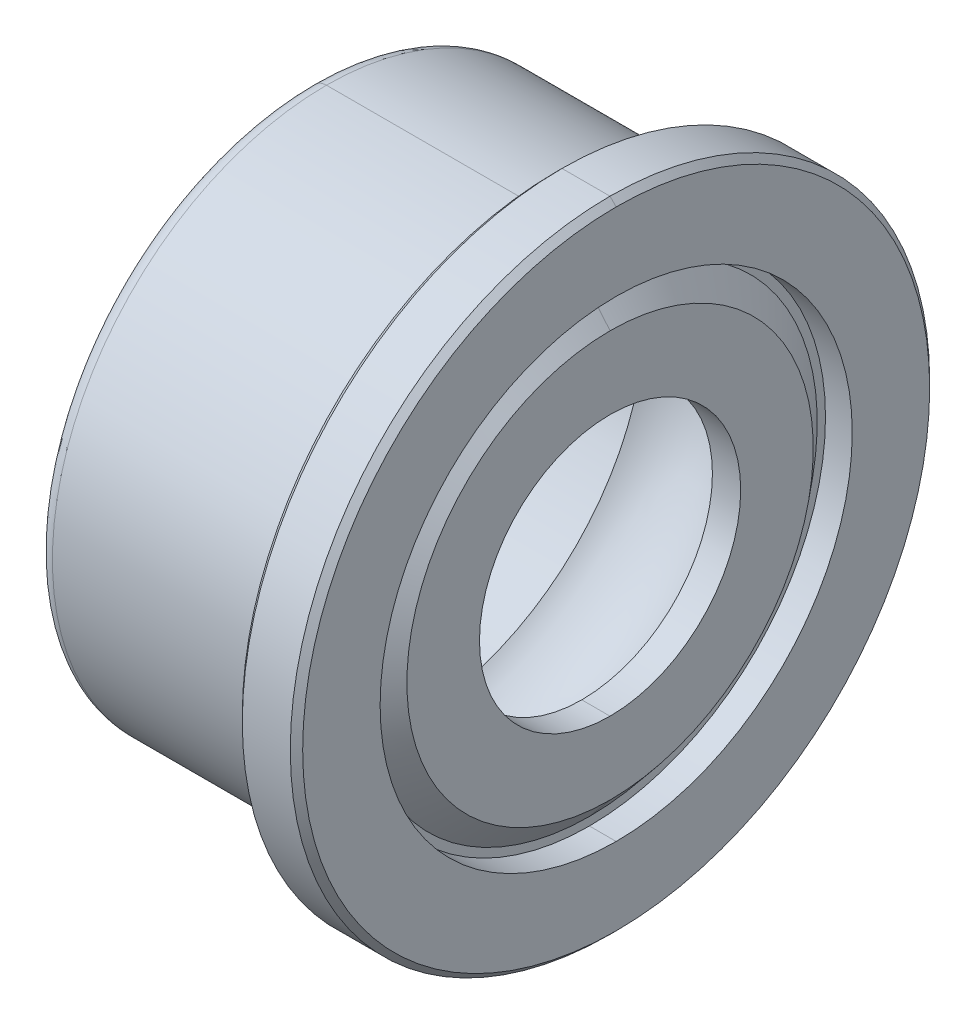
ISO-10303-21;
HEADER;
FILE_DESCRIPTION(('STEP AP214'),'2;1');
FILE_NAME('part.step','',(''),(''),'','','');
FILE_SCHEMA(('AUTOMOTIVE_DESIGN { 1 0 10303 214 1 1 1 1 }'));
ENDSEC;
DATA;
#1=APPLICATION_CONTEXT('core data for automotive mechanical design processes');
#2=APPLICATION_PROTOCOL_DEFINITION('international standard','automotive_design',2000,#1);
#3=PRODUCT_CONTEXT('',#1,'mechanical');
#4=PRODUCT('Part','Part','',(#3));
#5=PRODUCT_RELATED_PRODUCT_CATEGORY('part','',(#4));
#6=PRODUCT_DEFINITION_FORMATION('','',#4);
#7=PRODUCT_DEFINITION_CONTEXT('part definition',#1,'design');
#8=PRODUCT_DEFINITION('design','',#6,#7);
#9=PRODUCT_DEFINITION_SHAPE('','',#8);
#10=(LENGTH_UNIT() NAMED_UNIT(*) SI_UNIT(.MILLI.,.METRE.));
#11=(NAMED_UNIT(*) PLANE_ANGLE_UNIT() SI_UNIT($,.RADIAN.));
#12=(NAMED_UNIT(*) SI_UNIT($,.STERADIAN.) SOLID_ANGLE_UNIT());
#13=UNCERTAINTY_MEASURE_WITH_UNIT(LENGTH_MEASURE(1.E-05),#10,'distance_accuracy_value','');
#14=(GEOMETRIC_REPRESENTATION_CONTEXT(3) GLOBAL_UNCERTAINTY_ASSIGNED_CONTEXT((#13)) GLOBAL_UNIT_ASSIGNED_CONTEXT((#10,
#11,#12)) REPRESENTATION_CONTEXT('',''));
#15=CARTESIAN_POINT('',(0.,0.,0.));
#16=DIRECTION('',(0.,0.,1.));
#17=DIRECTION('',(1.,0.,0.));
#18=AXIS2_PLACEMENT_3D('',#15,#16,#17);
#19=CARTESIAN_POINT('',(-2.75209,0.,0.));
#20=DIRECTION('',(1.,0.,0.));
#21=DIRECTION('',(0.,-1.,0.));
#22=AXIS2_PLACEMENT_3D('',#19,#20,#21);
#23=CYLINDRICAL_SURFACE('',#22,3.872865);
#24=DIRECTION('',(1.,0.,0.));
#25=VECTOR('',#24,1.);
#26=CARTESIAN_POINT('',(0.893356989268567,3.872865,0.));
#27=LINE('',#26,#25);
#28=CARTESIAN_POINT('',(0.893356989268568,3.872865,0.));
#29=VERTEX_POINT('',#28);
#30=CARTESIAN_POINT('',(1.93804322400718,3.872865,0.));
#31=VERTEX_POINT('',#30);
#32=EDGE_CURVE('E20',#29,#31,#27,.T.);
#33=ORIENTED_EDGE('',*,*,#32,.F.);
#34=CARTESIAN_POINT('',(0.893356989268566,0.,0.));
#35=DIRECTION('',(-1.,0.,0.));
#36=DIRECTION('',(0.,1.,0.));
#37=AXIS2_PLACEMENT_3D('',#34,#35,#36);
#38=CIRCLE('',#37,3.872865);
#39=CARTESIAN_POINT('',(0.893356989268568,-3.872865,0.));
#40=VERTEX_POINT('',#39);
#41=EDGE_CURVE('E285',#29,#40,#38,.T.);
#42=ORIENTED_EDGE('',*,*,#41,.T.);
#43=DIRECTION('',(1.,0.,0.));
#44=VECTOR('',#43,1.);
#45=CARTESIAN_POINT('',(0.893356989268567,-3.872865,0.));
#46=LINE('',#45,#44);
#47=CARTESIAN_POINT('',(1.93804322400718,-3.872865,0.));
#48=VERTEX_POINT('',#47);
#49=EDGE_CURVE('E25',#40,#48,#46,.T.);
#50=ORIENTED_EDGE('',*,*,#49,.T.);
#51=CARTESIAN_POINT('',(1.93804322400718,0.,0.));
#52=DIRECTION('',(1.,0.,0.));
#53=DIRECTION('',(0.,-1.,0.));
#54=AXIS2_PLACEMENT_3D('',#51,#52,#53);
#55=CIRCLE('',#54,3.872865);
#56=EDGE_CURVE('E11',#48,#31,#55,.T.);
#57=ORIENTED_EDGE('',*,*,#56,.T.);
#58=EDGE_LOOP('',(#33,#42,#50,#57));
#59=FACE_BOUND('',#58,.T.);
#60=ADVANCED_FACE('F17',(#59),#23,.F.);
#61=CARTESIAN_POINT('',(1.93804322400718,0.,0.));
#62=DIRECTION('',(1.,0.,0.));
#63=DIRECTION('',(0.,-1.,0.));
#64=AXIS2_PLACEMENT_3D('',#61,#62,#63);
#65=PLANE('',#64);
#66=CARTESIAN_POINT('',(1.93804322400718,0.,0.));
#67=DIRECTION('',(-1.,0.,0.));
#68=DIRECTION('',(0.,1.,0.));
#69=AXIS2_PLACEMENT_3D('',#66,#67,#68);
#70=CIRCLE('',#69,2.14275035);
#71=CARTESIAN_POINT('',(1.93804322400718,2.14275035,0.));
#72=VERTEX_POINT('',#71);
#73=CARTESIAN_POINT('',(1.93804322400718,-2.14275035,0.));
#74=VERTEX_POINT('',#73);
#75=EDGE_CURVE('E845',#72,#74,#70,.T.);
#76=ORIENTED_EDGE('',*,*,#75,.F.);
#77=CARTESIAN_POINT('',(1.93804322400718,0.,0.));
#78=DIRECTION('',(1.,0.,0.));
#79=DIRECTION('',(0.,1.,0.));
#80=AXIS2_PLACEMENT_3D('',#77,#78,#79);
#81=CIRCLE('',#80,2.14275035);
#82=EDGE_CURVE('E847',#72,#74,#81,.T.);
#83=ORIENTED_EDGE('',*,*,#82,.T.);
#84=EDGE_LOOP('',(#76,#83));
#85=FACE_BOUND('',#84,.T.);
#86=ORIENTED_EDGE('',*,*,#56,.F.);
#87=CARTESIAN_POINT('',(1.93804322400718,0.,0.));
#88=DIRECTION('',(1.,0.,0.));
#89=DIRECTION('',(0.,1.,0.));
#90=AXIS2_PLACEMENT_3D('',#87,#88,#89);
#91=CIRCLE('',#90,3.872865);
#92=EDGE_CURVE('E294',#31,#48,#91,.T.);
#93=ORIENTED_EDGE('',*,*,#92,.F.);
#94=EDGE_LOOP('',(#86,#93));
#95=FACE_BOUND('',#94,.T.);
#96=ADVANCED_FACE('F336',(#85,#95),#65,.F.);
#97=CARTESIAN_POINT('',(-2.75209,0.,0.));
#98=DIRECTION('',(1.,0.,0.));
#99=DIRECTION('',(0.,-1.,0.));
#100=AXIS2_PLACEMENT_3D('',#97,#98,#99);
#101=CYLINDRICAL_SURFACE('',#100,3.872865);
#102=ORIENTED_EDGE('',*,*,#49,.F.);
#103=CARTESIAN_POINT('',(0.893356989268566,0.,0.));
#104=DIRECTION('',(1.,0.,0.));
#105=DIRECTION('',(0.,1.,0.));
#106=AXIS2_PLACEMENT_3D('',#103,#104,#105);
#107=CIRCLE('',#106,3.872865);
#108=EDGE_CURVE('E289',#29,#40,#107,.T.);
#109=ORIENTED_EDGE('',*,*,#108,.F.);
#110=ORIENTED_EDGE('',*,*,#32,.T.);
#111=ORIENTED_EDGE('',*,*,#92,.T.);
#112=EDGE_LOOP('',(#102,#109,#110,#111));
#113=FACE_BOUND('',#112,.T.);
#114=ADVANCED_FACE('F308',(#113),#101,.F.);
#115=CARTESIAN_POINT('',(0.,0.,0.));
#116=DIRECTION('',(1.,0.,0.));
#117=DIRECTION('',(0.,-1.,0.));
#118=AXIS2_PLACEMENT_3D('',#115,#116,#117);
#119=TOROIDAL_SURFACE('',#118,2.9972,1.25095);
#120=ORIENTED_EDGE('',*,*,#108,.T.);
#121=CARTESIAN_POINT('',(0.,-2.9972,0.));
#122=DIRECTION('',(0.,0.,1.));
#123=DIRECTION('',(-0.714142842854285,-0.7,0.));
#124=AXIS2_PLACEMENT_3D('',#121,#122,#123);
#125=CIRCLE('',#124,1.25095);
#126=CARTESIAN_POINT('',(-0.893356989268568,-3.872865,0.));
#127=VERTEX_POINT('',#126);
#128=EDGE_CURVE('E286',#127,#40,#125,.T.);
#129=ORIENTED_EDGE('',*,*,#128,.F.);
#130=CARTESIAN_POINT('',(-0.893356989268568,0.,0.));
#131=DIRECTION('',(1.,0.,0.));
#132=DIRECTION('',(0.,1.,0.));
#133=AXIS2_PLACEMENT_3D('',#130,#131,#132);
#134=CIRCLE('',#133,3.872865);
#135=CARTESIAN_POINT('',(-0.893356989268568,3.872865,0.));
#136=VERTEX_POINT('',#135);
#137=EDGE_CURVE('E279',#136,#127,#134,.T.);
#138=ORIENTED_EDGE('',*,*,#137,.F.);
#139=CARTESIAN_POINT('',(0.,2.9972,0.));
#140=DIRECTION('',(0.,0.,-1.));
#141=DIRECTION('',(-0.714142842854285,0.7,0.));
#142=AXIS2_PLACEMENT_3D('',#139,#140,#141);
#143=CIRCLE('',#142,1.25095);
#144=EDGE_CURVE('E282',#136,#29,#143,.T.);
#145=ORIENTED_EDGE('',*,*,#144,.T.);
#146=EDGE_LOOP('',(#120,#129,#138,#145));
#147=FACE_BOUND('',#146,.T.);
#148=ADVANCED_FACE('F311',(#147),#119,.F.);
#149=CARTESIAN_POINT('',(0.,0.,0.));
#150=DIRECTION('',(1.,0.,0.));
#151=DIRECTION('',(0.,-1.,0.));
#152=AXIS2_PLACEMENT_3D('',#149,#150,#151);
#153=TOROIDAL_SURFACE('',#152,2.9972,1.25095);
#154=CARTESIAN_POINT('',(-0.893356989268568,0.,0.));
#155=DIRECTION('',(-1.,0.,0.));
#156=DIRECTION('',(0.,1.,0.));
#157=AXIS2_PLACEMENT_3D('',#154,#155,#156);
#158=CIRCLE('',#157,3.872865);
#159=EDGE_CURVE('E278',#136,#127,#158,.T.);
#160=ORIENTED_EDGE('',*,*,#159,.T.);
#161=ORIENTED_EDGE('',*,*,#128,.T.);
#162=ORIENTED_EDGE('',*,*,#41,.F.);
#163=ORIENTED_EDGE('',*,*,#144,.F.);
#164=EDGE_LOOP('',(#160,#161,#162,#163));
#165=FACE_BOUND('',#164,.T.);
#166=ADVANCED_FACE('F312',(#165),#153,.F.);
#167=CARTESIAN_POINT('',(-2.75209,0.,0.));
#168=DIRECTION('',(1.,0.,0.));
#169=DIRECTION('',(0.,-1.,0.));
#170=AXIS2_PLACEMENT_3D('',#167,#168,#169);
#171=CYLINDRICAL_SURFACE('',#170,3.872865);
#172=DIRECTION('',(1.,0.,0.));
#173=VECTOR('',#172,1.);
#174=CARTESIAN_POINT('',(-1.93804322400718,-3.872865,0.));
#175=LINE('',#174,#173);
#176=CARTESIAN_POINT('',(-1.93804322400718,-3.872865,0.));
#177=VERTEX_POINT('',#176);
#178=EDGE_CURVE('E274',#177,#127,#175,.T.);
#179=ORIENTED_EDGE('',*,*,#178,.T.);
#180=ORIENTED_EDGE('',*,*,#159,.F.);
#181=DIRECTION('',(1.,0.,0.));
#182=VECTOR('',#181,1.);
#183=CARTESIAN_POINT('',(-1.93804322400718,3.872865,0.));
#184=LINE('',#183,#182);
#185=CARTESIAN_POINT('',(-1.93804322400718,3.872865,0.));
#186=VERTEX_POINT('',#185);
#187=EDGE_CURVE('E275',#186,#136,#184,.T.);
#188=ORIENTED_EDGE('',*,*,#187,.F.);
#189=CARTESIAN_POINT('',(-1.93804322400718,0.,0.));
#190=DIRECTION('',(1.,0.,0.));
#191=DIRECTION('',(0.,-1.,0.));
#192=AXIS2_PLACEMENT_3D('',#189,#190,#191);
#193=CIRCLE('',#192,3.872865);
#194=EDGE_CURVE('E271',#177,#186,#193,.T.);
#195=ORIENTED_EDGE('',*,*,#194,.F.);
#196=EDGE_LOOP('',(#179,#180,#188,#195));
#197=FACE_BOUND('',#196,.T.);
#198=ADVANCED_FACE('F316',(#197),#171,.F.);
#199=CARTESIAN_POINT('',(-2.75209,0.,0.));
#200=DIRECTION('',(1.,0.,0.));
#201=DIRECTION('',(0.,-1.,0.));
#202=AXIS2_PLACEMENT_3D('',#199,#200,#201);
#203=CYLINDRICAL_SURFACE('',#202,3.872865);
#204=ORIENTED_EDGE('',*,*,#187,.T.);
#205=ORIENTED_EDGE('',*,*,#137,.T.);
#206=ORIENTED_EDGE('',*,*,#178,.F.);
#207=CARTESIAN_POINT('',(-1.93804322400718,0.,0.));
#208=DIRECTION('',(1.,0.,0.));
#209=DIRECTION('',(0.,1.,0.));
#210=AXIS2_PLACEMENT_3D('',#207,#208,#209);
#211=CIRCLE('',#210,3.872865);
#212=EDGE_CURVE('E266',#186,#177,#211,.T.);
#213=ORIENTED_EDGE('',*,*,#212,.F.);
#214=EDGE_LOOP('',(#204,#205,#206,#213));
#215=FACE_BOUND('',#214,.T.);
#216=ADVANCED_FACE('F319',(#215),#203,.F.);
#217=CARTESIAN_POINT('',(-1.93804322400718,0.,0.));
#218=DIRECTION('',(1.,0.,0.));
#219=DIRECTION('',(0.,-1.,0.));
#220=AXIS2_PLACEMENT_3D('',#217,#218,#219);
#221=PLANE('',#220);
#222=CARTESIAN_POINT('',(-1.93804322400718,0.,0.));
#223=DIRECTION('',(1.,0.,0.));
#224=DIRECTION('',(0.,1.,0.));
#225=AXIS2_PLACEMENT_3D('',#222,#223,#224);
#226=CIRCLE('',#225,2.14275035);
#227=CARTESIAN_POINT('',(-1.93804322400718,2.14275035,0.));
#228=VERTEX_POINT('',#227);
#229=CARTESIAN_POINT('',(-1.93804322400718,-2.14275035,0.));
#230=VERTEX_POINT('',#229);
#231=EDGE_CURVE('E262',#228,#230,#226,.T.);
#232=ORIENTED_EDGE('',*,*,#231,.F.);
#233=CARTESIAN_POINT('',(-1.93804322400718,0.,0.));
#234=DIRECTION('',(-1.,0.,0.));
#235=DIRECTION('',(0.,1.,0.));
#236=AXIS2_PLACEMENT_3D('',#233,#234,#235);
#237=CIRCLE('',#236,2.14275035);
#238=EDGE_CURVE('E264',#228,#230,#237,.T.);
#239=ORIENTED_EDGE('',*,*,#238,.T.);
#240=EDGE_LOOP('',(#232,#239));
#241=FACE_BOUND('',#240,.T.);
#242=ORIENTED_EDGE('',*,*,#194,.T.);
#243=ORIENTED_EDGE('',*,*,#212,.T.);
#244=EDGE_LOOP('',(#242,#243));
#245=FACE_BOUND('',#244,.T.);
#246=ADVANCED_FACE('F321',(#241,#245),#221,.T.);
#247=CARTESIAN_POINT('',(-2.6420064,0.,0.));
#248=DIRECTION('',(1.,0.,0.));
#249=DIRECTION('',(0.,-1.,0.));
#250=AXIS2_PLACEMENT_3D('',#247,#248,#249);
#251=CYLINDRICAL_SURFACE('',#250,2.14275035);
#252=CARTESIAN_POINT('',(-2.401824,0.,0.));
#253=DIRECTION('',(-1.,0.,0.));
#254=DIRECTION('',(0.,1.,0.));
#255=AXIS2_PLACEMENT_3D('',#252,#253,#254);
#256=CIRCLE('',#255,2.14275035);
#257=CARTESIAN_POINT('',(-2.401824,2.14275035,0.));
#258=VERTEX_POINT('',#257);
#259=CARTESIAN_POINT('',(-2.401824,-2.14275035,0.));
#260=VERTEX_POINT('',#259);
#261=EDGE_CURVE('E255',#258,#260,#256,.T.);
#262=ORIENTED_EDGE('',*,*,#261,.T.);
#263=DIRECTION('',(1.,0.,0.));
#264=VECTOR('',#263,1.);
#265=CARTESIAN_POINT('',(-2.401824,-2.14275035,0.));
#266=LINE('',#265,#264);
#267=EDGE_CURVE('E259',#260,#230,#266,.T.);
#268=ORIENTED_EDGE('',*,*,#267,.T.);
#269=ORIENTED_EDGE('',*,*,#238,.F.);
#270=DIRECTION('',(1.,0.,0.));
#271=VECTOR('',#270,1.);
#272=CARTESIAN_POINT('',(-2.401824,2.14275035,0.));
#273=LINE('',#272,#271);
#274=EDGE_CURVE('E256',#258,#228,#273,.T.);
#275=ORIENTED_EDGE('',*,*,#274,.F.);
#276=EDGE_LOOP('',(#262,#268,#269,#275));
#277=FACE_BOUND('',#276,.T.);
#278=ADVANCED_FACE('F323',(#277),#251,.F.);
#279=CARTESIAN_POINT('',(-2.6420064,0.,0.));
#280=DIRECTION('',(1.,0.,0.));
#281=DIRECTION('',(0.,-1.,0.));
#282=AXIS2_PLACEMENT_3D('',#279,#280,#281);
#283=CYLINDRICAL_SURFACE('',#282,2.14275035);
#284=ORIENTED_EDGE('',*,*,#231,.T.);
#285=ORIENTED_EDGE('',*,*,#267,.F.);
#286=CARTESIAN_POINT('',(-2.401824,0.,0.));
#287=DIRECTION('',(1.,0.,0.));
#288=DIRECTION('',(0.,1.,0.));
#289=AXIS2_PLACEMENT_3D('',#286,#287,#288);
#290=CIRCLE('',#289,2.14275035);
#291=EDGE_CURVE('E250',#258,#260,#290,.T.);
#292=ORIENTED_EDGE('',*,*,#291,.F.);
#293=ORIENTED_EDGE('',*,*,#274,.T.);
#294=EDGE_LOOP('',(#284,#285,#292,#293));
#295=FACE_BOUND('',#294,.T.);
#296=ADVANCED_FACE('F331',(#295),#283,.F.);
#297=CARTESIAN_POINT('',(-2.401824,0.,0.));
#298=DIRECTION('',(1.,0.,0.));
#299=DIRECTION('',(0.,-1.,0.));
#300=AXIS2_PLACEMENT_3D('',#297,#298,#299);
#301=PLANE('',#300);
#302=ORIENTED_EDGE('',*,*,#261,.F.);
#303=ORIENTED_EDGE('',*,*,#291,.T.);
#304=EDGE_LOOP('',(#302,#303));
#305=FACE_BOUND('',#304,.T.);
#306=CARTESIAN_POINT('',(-2.401824,0.,0.));
#307=DIRECTION('',(1.,0.,0.));
#308=DIRECTION('',(0.,1.,0.));
#309=AXIS2_PLACEMENT_3D('',#306,#307,#308);
#310=CIRCLE('',#309,3.3336847347);
#311=CARTESIAN_POINT('',(-2.401824,3.3336847347,0.));
#312=VERTEX_POINT('',#311);
#313=CARTESIAN_POINT('',(-2.401824,-3.3336847347,0.));
#314=VERTEX_POINT('',#313);
#315=EDGE_CURVE('E246',#312,#314,#310,.T.);
#316=ORIENTED_EDGE('',*,*,#315,.F.);
#317=CARTESIAN_POINT('',(-2.401824,0.,0.));
#318=DIRECTION('',(-1.,0.,0.));
#319=DIRECTION('',(0.,1.,0.));
#320=AXIS2_PLACEMENT_3D('',#317,#318,#319);
#321=CIRCLE('',#320,3.3336847347);
#322=EDGE_CURVE('E248',#312,#314,#321,.T.);
#323=ORIENTED_EDGE('',*,*,#322,.T.);
#324=EDGE_LOOP('',(#316,#323));
#325=FACE_BOUND('',#324,.T.);
#326=ADVANCED_FACE('F387',(#305,#325),#301,.F.);
#327=CARTESIAN_POINT('',(-2.41390058018481,0.,0.));
#328=DIRECTION('',(1.,0.,0.));
#329=DIRECTION('',(0.,-1.,0.));
#330=AXIS2_PLACEMENT_3D('',#327,#328,#329);
#331=CONICAL_SURFACE('',#330,3.3192924268785,0.872664625997165);
#332=CARTESIAN_POINT('',(-2.06313822400718,0.,0.));
#333=DIRECTION('',(-1.,0.,0.));
#334=DIRECTION('',(0.,1.,0.));
#335=AXIS2_PLACEMENT_3D('',#332,#333,#334);
#336=CIRCLE('',#335,3.737314725);
#337=CARTESIAN_POINT('',(-2.06313822400718,3.737314725,0.));
#338=VERTEX_POINT('',#337);
#339=CARTESIAN_POINT('',(-2.06313822400718,-3.737314725,0.));
#340=VERTEX_POINT('',#339);
#341=EDGE_CURVE('E239',#338,#340,#336,.T.);
#342=ORIENTED_EDGE('',*,*,#341,.T.);
#343=DIRECTION('',(-0.642787609686539,0.766044443118978,0.));
#344=VECTOR('',#343,1.);
#345=CARTESIAN_POINT('',(-2.06313822400718,-3.737314725,0.));
#346=LINE('',#345,#344);
#347=EDGE_CURVE('E243',#340,#314,#346,.T.);
#348=ORIENTED_EDGE('',*,*,#347,.T.);
#349=ORIENTED_EDGE('',*,*,#322,.F.);
#350=DIRECTION('',(-0.642787609686539,-0.766044443118978,0.));
#351=VECTOR('',#350,1.);
#352=CARTESIAN_POINT('',(-2.06313822400718,3.737314725,0.));
#353=LINE('',#352,#351);
#354=EDGE_CURVE('E240',#338,#312,#353,.T.);
#355=ORIENTED_EDGE('',*,*,#354,.F.);
#356=EDGE_LOOP('',(#342,#348,#349,#355));
#357=FACE_BOUND('',#356,.T.);
#358=ADVANCED_FACE('F398',(#357),#331,.T.);
#359=CARTESIAN_POINT('',(-2.41390058018481,0.,0.));
#360=DIRECTION('',(1.,0.,0.));
#361=DIRECTION('',(0.,-1.,0.));
#362=AXIS2_PLACEMENT_3D('',#359,#360,#361);
#363=CONICAL_SURFACE('',#362,3.3192924268785,0.872664625997165);
#364=ORIENTED_EDGE('',*,*,#315,.T.);
#365=ORIENTED_EDGE('',*,*,#347,.F.);
#366=CARTESIAN_POINT('',(-2.06313822400718,0.,0.));
#367=DIRECTION('',(1.,0.,0.));
#368=DIRECTION('',(0.,1.,0.));
#369=AXIS2_PLACEMENT_3D('',#366,#367,#368);
#370=CIRCLE('',#369,3.737314725);
#371=EDGE_CURVE('E231',#338,#340,#370,.T.);
#372=ORIENTED_EDGE('',*,*,#371,.F.);
#373=ORIENTED_EDGE('',*,*,#354,.T.);
#374=EDGE_LOOP('',(#364,#365,#372,#373));
#375=FACE_BOUND('',#374,.T.);
#376=ADVANCED_FACE('F409',(#375),#363,.T.);
#377=CARTESIAN_POINT('',(-2.75209,0.,0.));
#378=DIRECTION('',(1.,0.,0.));
#379=DIRECTION('',(0.,-1.,0.));
#380=AXIS2_PLACEMENT_3D('',#377,#378,#379);
#381=CYLINDRICAL_SURFACE('',#380,3.872865);
#382=DIRECTION('',(1.,0.,0.));
#383=VECTOR('',#382,1.);
#384=CARTESIAN_POINT('',(-2.5019,3.872865,0.));
#385=LINE('',#384,#383);
#386=CARTESIAN_POINT('',(-2.5019,3.872865,0.));
#387=VERTEX_POINT('',#386);
#388=CARTESIAN_POINT('',(-2.06313822400718,3.872865,0.));
#389=VERTEX_POINT('',#388);
#390=EDGE_CURVE('E225',#387,#389,#385,.T.);
#391=ORIENTED_EDGE('',*,*,#390,.F.);
#392=CARTESIAN_POINT('',(-2.5019,0.,0.));
#393=DIRECTION('',(-1.,0.,0.));
#394=DIRECTION('',(0.,1.,0.));
#395=AXIS2_PLACEMENT_3D('',#392,#393,#394);
#396=CIRCLE('',#395,3.872865);
#397=CARTESIAN_POINT('',(-2.5019,-3.872865,0.));
#398=VERTEX_POINT('',#397);
#399=EDGE_CURVE('E226',#387,#398,#396,.T.);
#400=ORIENTED_EDGE('',*,*,#399,.T.);
#401=DIRECTION('',(1.,0.,0.));
#402=VECTOR('',#401,1.);
#403=CARTESIAN_POINT('',(-2.5019,-3.872865,0.));
#404=LINE('',#403,#402);
#405=CARTESIAN_POINT('',(-2.06313822400718,-3.872865,0.));
#406=VERTEX_POINT('',#405);
#407=EDGE_CURVE('E232',#398,#406,#404,.T.);
#408=ORIENTED_EDGE('',*,*,#407,.T.);
#409=CARTESIAN_POINT('',(-2.06313822400718,0.,0.));
#410=DIRECTION('',(1.,0.,0.));
#411=DIRECTION('',(0.,-1.,0.));
#412=AXIS2_PLACEMENT_3D('',#409,#410,#411);
#413=CIRCLE('',#412,3.872865);
#414=EDGE_CURVE('E229',#406,#389,#413,.T.);
#415=ORIENTED_EDGE('',*,*,#414,.T.);
#416=EDGE_LOOP('',(#391,#400,#408,#415));
#417=FACE_BOUND('',#416,.T.);
#418=ADVANCED_FACE('F420',(#417),#381,.F.);
#419=CARTESIAN_POINT('',(-2.06313822400718,0.,0.));
#420=DIRECTION('',(1.,0.,0.));
#421=DIRECTION('',(0.,-1.,0.));
#422=AXIS2_PLACEMENT_3D('',#419,#420,#421);
#423=PLANE('',#422);
#424=ORIENTED_EDGE('',*,*,#341,.F.);
#425=ORIENTED_EDGE('',*,*,#371,.T.);
#426=EDGE_LOOP('',(#424,#425));
#427=FACE_BOUND('',#426,.T.);
#428=ORIENTED_EDGE('',*,*,#414,.F.);
#429=CARTESIAN_POINT('',(-2.06313822400718,0.,0.));
#430=DIRECTION('',(1.,0.,0.));
#431=DIRECTION('',(0.,1.,0.));
#432=AXIS2_PLACEMENT_3D('',#429,#430,#431);
#433=CIRCLE('',#432,3.872865);
#434=EDGE_CURVE('E222',#389,#406,#433,.T.);
#435=ORIENTED_EDGE('',*,*,#434,.F.);
#436=EDGE_LOOP('',(#428,#435));
#437=FACE_BOUND('',#436,.T.);
#438=ADVANCED_FACE('F431',(#427,#437),#423,.F.);
#439=CARTESIAN_POINT('',(-2.75209,0.,0.));
#440=DIRECTION('',(1.,0.,0.));
#441=DIRECTION('',(0.,-1.,0.));
#442=AXIS2_PLACEMENT_3D('',#439,#440,#441);
#443=CYLINDRICAL_SURFACE('',#442,3.872865);
#444=ORIENTED_EDGE('',*,*,#407,.F.);
#445=CARTESIAN_POINT('',(-2.5019,0.,0.));
#446=DIRECTION('',(1.,0.,0.));
#447=DIRECTION('',(0.,1.,0.));
#448=AXIS2_PLACEMENT_3D('',#445,#446,#447);
#449=CIRCLE('',#448,3.872865);
#450=EDGE_CURVE('E221',#387,#398,#449,.T.);
#451=ORIENTED_EDGE('',*,*,#450,.F.);
#452=ORIENTED_EDGE('',*,*,#390,.T.);
#453=ORIENTED_EDGE('',*,*,#434,.T.);
#454=EDGE_LOOP('',(#444,#451,#452,#453));
#455=FACE_BOUND('',#454,.T.);
#456=ADVANCED_FACE('F442',(#455),#443,.F.);
#457=CARTESIAN_POINT('',(-2.5019,0.,0.));
#458=DIRECTION('',(1.,0.,0.));
#459=DIRECTION('',(0.,-1.,0.));
#460=AXIS2_PLACEMENT_3D('',#457,#458,#459);
#461=PLANE('',#460);
#462=ORIENTED_EDGE('',*,*,#399,.F.);
#463=ORIENTED_EDGE('',*,*,#450,.T.);
#464=EDGE_LOOP('',(#462,#463));
#465=FACE_BOUND('',#464,.T.);
#466=CARTESIAN_POINT('',(-2.5019,0.,0.));
#467=DIRECTION('',(1.,0.,0.));
#468=DIRECTION('',(0.,1.,0.));
#469=AXIS2_PLACEMENT_3D('',#466,#467,#468);
#470=CIRCLE('',#469,4.24561);
#471=CARTESIAN_POINT('',(-2.5019,4.24561,0.));
#472=VERTEX_POINT('',#471);
#473=CARTESIAN_POINT('',(-2.5019,-4.24561,0.));
#474=VERTEX_POINT('',#473);
#475=EDGE_CURVE('E217',#472,#474,#470,.T.);
#476=ORIENTED_EDGE('',*,*,#475,.F.);
#477=CARTESIAN_POINT('',(-2.5019,0.,0.));
#478=DIRECTION('',(-1.,0.,0.));
#479=DIRECTION('',(0.,1.,0.));
#480=AXIS2_PLACEMENT_3D('',#477,#478,#479);
#481=CIRCLE('',#480,4.24561);
#482=EDGE_CURVE('E196',#472,#474,#481,.T.);
#483=ORIENTED_EDGE('',*,*,#482,.T.);
#484=EDGE_LOOP('',(#476,#483));
#485=FACE_BOUND('',#484,.T.);
#486=ADVANCED_FACE('F453',(#465,#485),#461,.F.);
#487=CARTESIAN_POINT('',(-2.25171,0.,0.));
#488=DIRECTION('',(1.,0.,0.));
#489=DIRECTION('',(0.,-1.,0.));
#490=AXIS2_PLACEMENT_3D('',#487,#488,#489);
#491=TOROIDAL_SURFACE('',#490,4.24561,0.25019);
#492=ORIENTED_EDGE('',*,*,#475,.T.);
#493=CARTESIAN_POINT('',(-2.25171,-4.24561,0.));
#494=DIRECTION('',(0.,0.,-1.));
#495=DIRECTION('',(0.,-1.,0.));
#496=AXIS2_PLACEMENT_3D('',#493,#494,#495);
#497=CIRCLE('',#496,0.25019);
#498=CARTESIAN_POINT('',(-2.25171,-4.4958,0.));
#499=VERTEX_POINT('',#498);
#500=EDGE_CURVE('E183',#499,#474,#497,.T.);
#501=ORIENTED_EDGE('',*,*,#500,.F.);
#502=CARTESIAN_POINT('',(-2.25171,0.,0.));
#503=DIRECTION('',(1.,0.,0.));
#504=DIRECTION('',(0.,1.,0.));
#505=AXIS2_PLACEMENT_3D('',#502,#503,#504);
#506=CIRCLE('',#505,4.4958);
#507=CARTESIAN_POINT('',(-2.25171,4.4958,0.));
#508=VERTEX_POINT('',#507);
#509=EDGE_CURVE('E176',#508,#499,#506,.T.);
#510=ORIENTED_EDGE('',*,*,#509,.F.);
#511=CARTESIAN_POINT('',(-2.25171,4.24561,0.));
#512=DIRECTION('',(0.,0.,1.));
#513=DIRECTION('',(0.,1.,0.));
#514=AXIS2_PLACEMENT_3D('',#511,#512,#513);
#515=CIRCLE('',#514,0.25019);
#516=EDGE_CURVE('E180',#508,#472,#515,.T.);
#517=ORIENTED_EDGE('',*,*,#516,.T.);
#518=EDGE_LOOP('',(#492,#501,#510,#517));
#519=FACE_BOUND('',#518,.T.);
#520=ADVANCED_FACE('F179',(#519),#491,.T.);
#521=CARTESIAN_POINT('',(-2.25171,0.,0.));
#522=DIRECTION('',(1.,0.,0.));
#523=DIRECTION('',(0.,-1.,0.));
#524=AXIS2_PLACEMENT_3D('',#521,#522,#523);
#525=TOROIDAL_SURFACE('',#524,4.24561,0.25019);
#526=CARTESIAN_POINT('',(-2.25171,0.,0.));
#527=DIRECTION('',(-1.,0.,0.));
#528=DIRECTION('',(0.,1.,0.));
#529=AXIS2_PLACEMENT_3D('',#526,#527,#528);
#530=CIRCLE('',#529,4.4958);
#531=EDGE_CURVE('E194',#508,#499,#530,.T.);
#532=ORIENTED_EDGE('',*,*,#531,.T.);
#533=ORIENTED_EDGE('',*,*,#500,.T.);
#534=ORIENTED_EDGE('',*,*,#482,.F.);
#535=ORIENTED_EDGE('',*,*,#516,.F.);
#536=EDGE_LOOP('',(#532,#533,#534,#535));
#537=FACE_BOUND('',#536,.T.);
#538=ADVANCED_FACE('F193',(#537),#525,.T.);
#539=CARTESIAN_POINT('',(1.3462,0.,0.));
#540=DIRECTION('',(1.,0.,0.));
#541=DIRECTION('',(0.,-1.,0.));
#542=AXIS2_PLACEMENT_3D('',#539,#540,#541);
#543=TOROIDAL_SURFACE('',#542,4.6609,0.1651);
#544=CARTESIAN_POINT('',(1.3462,4.6609,0.));
#545=DIRECTION('',(0.,0.,-1.));
#546=DIRECTION('',(1.,0.,0.));
#547=AXIS2_PLACEMENT_3D('',#544,#545,#546);
#548=CIRCLE('',#547,0.1651);
#549=CARTESIAN_POINT('',(1.5113,4.6609,0.));
#550=VERTEX_POINT('',#549);
#551=CARTESIAN_POINT('',(1.3462,4.4958,0.));
#552=VERTEX_POINT('',#551);
#553=EDGE_CURVE('E212',#550,#552,#548,.T.);
#554=ORIENTED_EDGE('',*,*,#553,.F.);
#555=CARTESIAN_POINT('',(1.5113,0.,0.));
#556=DIRECTION('',(-1.,0.,0.));
#557=DIRECTION('',(0.,1.,0.));
#558=AXIS2_PLACEMENT_3D('',#555,#556,#557);
#559=CIRCLE('',#558,4.6609);
#560=CARTESIAN_POINT('',(1.5113,-4.6609,0.));
#561=VERTEX_POINT('',#560);
#562=EDGE_CURVE('E213',#550,#561,#559,.T.);
#563=ORIENTED_EDGE('',*,*,#562,.T.);
#564=CARTESIAN_POINT('',(1.3462,-4.6609,0.));
#565=DIRECTION('',(0.,0.,1.));
#566=DIRECTION('',(1.,0.,0.));
#567=AXIS2_PLACEMENT_3D('',#564,#565,#566);
#568=CIRCLE('',#567,0.1651);
#569=CARTESIAN_POINT('',(1.3462,-4.4958,0.));
#570=VERTEX_POINT('',#569);
#571=EDGE_CURVE('E33',#561,#570,#568,.T.);
#572=ORIENTED_EDGE('',*,*,#571,.T.);
#573=CARTESIAN_POINT('',(1.3462,0.,0.));
#574=DIRECTION('',(1.,0.,0.));
#575=DIRECTION('',(0.,-1.,0.));
#576=AXIS2_PLACEMENT_3D('',#573,#574,#575);
#577=CIRCLE('',#576,4.4958);
#578=EDGE_CURVE('E37',#570,#552,#577,.T.);
#579=ORIENTED_EDGE('',*,*,#578,.T.);
#580=EDGE_LOOP('',(#554,#563,#572,#579));
#581=FACE_BOUND('',#580,.T.);
#582=ADVANCED_FACE('F483',(#581),#543,.F.);
#583=CARTESIAN_POINT('',(-2.75209,0.,0.));
#584=DIRECTION('',(1.,0.,0.));
#585=DIRECTION('',(0.,-1.,0.));
#586=AXIS2_PLACEMENT_3D('',#583,#584,#585);
#587=CYLINDRICAL_SURFACE('',#586,4.4958);
#588=DIRECTION('',(-1.,0.,0.));
#589=VECTOR('',#588,1.);
#590=CARTESIAN_POINT('',(1.3462,-4.4958,0.));
#591=LINE('',#590,#589);
#592=EDGE_CURVE('E189',#570,#499,#591,.T.);
#593=ORIENTED_EDGE('',*,*,#592,.T.);
#594=ORIENTED_EDGE('',*,*,#531,.F.);
#595=DIRECTION('',(-1.,0.,0.));
#596=VECTOR('',#595,1.);
#597=CARTESIAN_POINT('',(1.3462,4.4958,0.));
#598=LINE('',#597,#596);
#599=EDGE_CURVE('E188',#552,#508,#598,.T.);
#600=ORIENTED_EDGE('',*,*,#599,.F.);
#601=ORIENTED_EDGE('',*,*,#578,.F.);
#602=EDGE_LOOP('',(#593,#594,#600,#601));
#603=FACE_BOUND('',#602,.T.);
#604=ADVANCED_FACE('F199',(#603),#587,.T.);
#605=CARTESIAN_POINT('',(-2.75209,0.,0.));
#606=DIRECTION('',(1.,0.,0.));
#607=DIRECTION('',(0.,-1.,0.));
#608=AXIS2_PLACEMENT_3D('',#605,#606,#607);
#609=CYLINDRICAL_SURFACE('',#608,4.4958);
#610=ORIENTED_EDGE('',*,*,#599,.T.);
#611=ORIENTED_EDGE('',*,*,#509,.T.);
#612=ORIENTED_EDGE('',*,*,#592,.F.);
#613=CARTESIAN_POINT('',(1.3462,0.,0.));
#614=DIRECTION('',(1.,0.,0.));
#615=DIRECTION('',(0.,1.,0.));
#616=AXIS2_PLACEMENT_3D('',#613,#614,#615);
#617=CIRCLE('',#616,4.4958);
#618=EDGE_CURVE('E204',#552,#570,#617,.T.);
#619=ORIENTED_EDGE('',*,*,#618,.F.);
#620=EDGE_LOOP('',(#610,#611,#612,#619));
#621=FACE_BOUND('',#620,.T.);
#622=ADVANCED_FACE('F202',(#621),#609,.T.);
#623=CARTESIAN_POINT('',(1.3462,0.,0.));
#624=DIRECTION('',(1.,0.,0.));
#625=DIRECTION('',(0.,-1.,0.));
#626=AXIS2_PLACEMENT_3D('',#623,#624,#625);
#627=TOROIDAL_SURFACE('',#626,4.6609,0.1651);
#628=ORIENTED_EDGE('',*,*,#571,.F.);
#629=CARTESIAN_POINT('',(1.5113,0.,0.));
#630=DIRECTION('',(1.,0.,0.));
#631=DIRECTION('',(0.,1.,0.));
#632=AXIS2_PLACEMENT_3D('',#629,#630,#631);
#633=CIRCLE('',#632,4.6609);
#634=EDGE_CURVE('E215',#550,#561,#633,.T.);
#635=ORIENTED_EDGE('',*,*,#634,.F.);
#636=ORIENTED_EDGE('',*,*,#553,.T.);
#637=ORIENTED_EDGE('',*,*,#618,.T.);
#638=EDGE_LOOP('',(#628,#635,#636,#637));
#639=FACE_BOUND('',#638,.T.);
#640=ADVANCED_FACE('F511',(#639),#627,.F.);
#641=CARTESIAN_POINT('',(1.5113,0.,0.));
#642=DIRECTION('',(1.,0.,0.));
#643=DIRECTION('',(0.,-1.,0.));
#644=AXIS2_PLACEMENT_3D('',#641,#642,#643);
#645=PLANE('',#644);
#646=ORIENTED_EDGE('',*,*,#562,.F.);
#647=ORIENTED_EDGE('',*,*,#634,.T.);
#648=EDGE_LOOP('',(#646,#647));
#649=FACE_BOUND('',#648,.T.);
#650=CARTESIAN_POINT('',(1.5113,0.,0.));
#651=DIRECTION('',(1.,0.,0.));
#652=DIRECTION('',(0.,1.,0.));
#653=AXIS2_PLACEMENT_3D('',#650,#651,#652);
#654=CIRCLE('',#653,5.1435);
#655=CARTESIAN_POINT('',(1.5113,5.1435,0.));
#656=VERTEX_POINT('',#655);
#657=CARTESIAN_POINT('',(1.5113,-5.1435,0.));
#658=VERTEX_POINT('',#657);
#659=EDGE_CURVE('E917',#656,#658,#654,.T.);
#660=ORIENTED_EDGE('',*,*,#659,.F.);
#661=CARTESIAN_POINT('',(1.5113,0.,0.));
#662=DIRECTION('',(-1.,0.,0.));
#663=DIRECTION('',(0.,1.,0.));
#664=AXIS2_PLACEMENT_3D('',#661,#662,#663);
#665=CIRCLE('',#664,5.1435);
#666=EDGE_CURVE('E919',#656,#658,#665,.T.);
#667=ORIENTED_EDGE('',*,*,#666,.T.);
#668=EDGE_LOOP('',(#660,#667));
#669=FACE_BOUND('',#668,.T.);
#670=ADVANCED_FACE('F521',(#649,#669),#645,.F.);
#671=CARTESIAN_POINT('',(1.49801500257078,0.,0.));
#672=DIRECTION('',(1.,0.,0.));
#673=DIRECTION('',(0.,-1.,0.));
#674=AXIS2_PLACEMENT_3D('',#671,#672,#673);
#675=CONICAL_SURFACE('',#674,5.13021500257078,0.785398163397446);
#676=CARTESIAN_POINT('',(1.6129,0.,0.));
#677=DIRECTION('',(-1.,0.,0.));
#678=DIRECTION('',(0.,1.,0.));
#679=AXIS2_PLACEMENT_3D('',#676,#677,#678);
#680=CIRCLE('',#679,5.2451);
#681=CARTESIAN_POINT('',(1.6129,5.2451,0.));
#682=VERTEX_POINT('',#681);
#683=CARTESIAN_POINT('',(1.6129,-5.2451,0.));
#684=VERTEX_POINT('',#683);
#685=EDGE_CURVE('E899',#682,#684,#680,.T.);
#686=ORIENTED_EDGE('',*,*,#685,.T.);
#687=DIRECTION('',(-0.707106781186551,0.707106781186545,0.));
#688=VECTOR('',#687,1.);
#689=CARTESIAN_POINT('',(1.6129,-5.2451,0.));
#690=LINE('',#689,#688);
#691=EDGE_CURVE('E914',#684,#658,#690,.T.);
#692=ORIENTED_EDGE('',*,*,#691,.T.);
#693=ORIENTED_EDGE('',*,*,#666,.F.);
#694=DIRECTION('',(-0.707106781186551,-0.707106781186545,0.));
#695=VECTOR('',#694,1.);
#696=CARTESIAN_POINT('',(1.6129,5.2451,0.));
#697=LINE('',#696,#695);
#698=EDGE_CURVE('E911',#682,#656,#697,.T.);
#699=ORIENTED_EDGE('',*,*,#698,.F.);
#700=EDGE_LOOP('',(#686,#692,#693,#699));
#701=FACE_BOUND('',#700,.T.);
#702=ADVANCED_FACE('F532',(#701),#675,.T.);
#703=CARTESIAN_POINT('',(1.49801500257078,0.,0.));
#704=DIRECTION('',(1.,0.,0.));
#705=DIRECTION('',(0.,-1.,0.));
#706=AXIS2_PLACEMENT_3D('',#703,#704,#705);
#707=CONICAL_SURFACE('',#706,5.13021500257078,0.785398163397446);
#708=ORIENTED_EDGE('',*,*,#659,.T.);
#709=ORIENTED_EDGE('',*,*,#691,.F.);
#710=CARTESIAN_POINT('',(1.6129,0.,0.));
#711=DIRECTION('',(1.,0.,0.));
#712=DIRECTION('',(0.,1.,0.));
#713=AXIS2_PLACEMENT_3D('',#710,#711,#712);
#714=CIRCLE('',#713,5.2451);
#715=EDGE_CURVE('E904',#682,#684,#714,.T.);
#716=ORIENTED_EDGE('',*,*,#715,.F.);
#717=ORIENTED_EDGE('',*,*,#698,.T.);
#718=EDGE_LOOP('',(#708,#709,#716,#717));
#719=FACE_BOUND('',#718,.T.);
#720=ADVANCED_FACE('F543',(#719),#707,.T.);
#721=CARTESIAN_POINT('',(1.288415,0.,0.));
#722=DIRECTION('',(1.,0.,0.));
#723=DIRECTION('',(0.,-1.,0.));
#724=AXIS2_PLACEMENT_3D('',#721,#722,#723);
#725=CYLINDRICAL_SURFACE('',#724,5.2451);
#726=ORIENTED_EDGE('',*,*,#715,.T.);
#727=DIRECTION('',(-1.,0.,0.));
#728=VECTOR('',#727,1.);
#729=CARTESIAN_POINT('',(2.4003,-5.2451,0.));
#730=LINE('',#729,#728);
#731=CARTESIAN_POINT('',(2.4003,-5.2451,0.));
#732=VERTEX_POINT('',#731);
#733=EDGE_CURVE('E901',#732,#684,#730,.T.);
#734=ORIENTED_EDGE('',*,*,#733,.F.);
#735=CARTESIAN_POINT('',(2.4003,0.,0.));
#736=DIRECTION('',(1.,0.,0.));
#737=DIRECTION('',(0.,1.,0.));
#738=AXIS2_PLACEMENT_3D('',#735,#736,#737);
#739=CIRCLE('',#738,5.2451);
#740=CARTESIAN_POINT('',(2.4003,5.2451,0.));
#741=VERTEX_POINT('',#740);
#742=EDGE_CURVE('E894',#741,#732,#739,.T.);
#743=ORIENTED_EDGE('',*,*,#742,.F.);
#744=DIRECTION('',(-1.,0.,0.));
#745=VECTOR('',#744,1.);
#746=CARTESIAN_POINT('',(2.4003,5.2451,0.));
#747=LINE('',#746,#745);
#748=EDGE_CURVE('E896',#741,#682,#747,.T.);
#749=ORIENTED_EDGE('',*,*,#748,.T.);
#750=EDGE_LOOP('',(#726,#734,#743,#749));
#751=FACE_BOUND('',#750,.T.);
#752=ADVANCED_FACE('F554',(#751),#725,.T.);
#753=CARTESIAN_POINT('',(1.288415,0.,0.));
#754=DIRECTION('',(1.,0.,0.));
#755=DIRECTION('',(0.,-1.,0.));
#756=AXIS2_PLACEMENT_3D('',#753,#754,#755);
#757=CYLINDRICAL_SURFACE('',#756,5.2451);
#758=CARTESIAN_POINT('',(2.4003,0.,0.));
#759=DIRECTION('',(-1.,0.,0.));
#760=DIRECTION('',(0.,1.,0.));
#761=AXIS2_PLACEMENT_3D('',#758,#759,#760);
#762=CIRCLE('',#761,5.2451);
#763=EDGE_CURVE('E900',#741,#732,#762,.T.);
#764=ORIENTED_EDGE('',*,*,#763,.T.);
#765=ORIENTED_EDGE('',*,*,#733,.T.);
#766=ORIENTED_EDGE('',*,*,#685,.F.);
#767=ORIENTED_EDGE('',*,*,#748,.F.);
#768=EDGE_LOOP('',(#764,#765,#766,#767));
#769=FACE_BOUND('',#768,.T.);
#770=ADVANCED_FACE('F565',(#769),#757,.T.);
#771=CARTESIAN_POINT('',(2.51518499742922,0.,0.));
#772=DIRECTION('',(-1.,0.,0.));
#773=DIRECTION('',(0.,1.,0.));
#774=AXIS2_PLACEMENT_3D('',#771,#772,#773);
#775=CONICAL_SURFACE('',#774,5.13021500257078,0.785398163397448);
#776=CARTESIAN_POINT('',(2.5019,0.,0.));
#777=DIRECTION('',(-1.,0.,0.));
#778=DIRECTION('',(0.,1.,0.));
#779=AXIS2_PLACEMENT_3D('',#776,#777,#778);
#780=CIRCLE('',#779,5.1435);
#781=CARTESIAN_POINT('',(2.5019,5.1435,0.));
#782=VERTEX_POINT('',#781);
#783=CARTESIAN_POINT('',(2.5019,-5.1435,0.));
#784=VERTEX_POINT('',#783);
#785=EDGE_CURVE('E887',#782,#784,#780,.T.);
#786=ORIENTED_EDGE('',*,*,#785,.T.);
#787=DIRECTION('',(-0.707106781186547,-0.707106781186547,0.));
#788=VECTOR('',#787,1.);
#789=CARTESIAN_POINT('',(2.5019,-5.1435,0.));
#790=LINE('',#789,#788);
#791=EDGE_CURVE('E891',#784,#732,#790,.T.);
#792=ORIENTED_EDGE('',*,*,#791,.T.);
#793=ORIENTED_EDGE('',*,*,#763,.F.);
#794=DIRECTION('',(-0.707106781186547,0.707106781186547,0.));
#795=VECTOR('',#794,1.);
#796=CARTESIAN_POINT('',(2.5019,5.1435,0.));
#797=LINE('',#796,#795);
#798=EDGE_CURVE('E888',#782,#741,#797,.T.);
#799=ORIENTED_EDGE('',*,*,#798,.F.);
#800=EDGE_LOOP('',(#786,#792,#793,#799));
#801=FACE_BOUND('',#800,.T.);
#802=ADVANCED_FACE('F576',(#801),#775,.T.);
#803=CARTESIAN_POINT('',(2.51518499742922,0.,0.));
#804=DIRECTION('',(-1.,0.,0.));
#805=DIRECTION('',(0.,1.,0.));
#806=AXIS2_PLACEMENT_3D('',#803,#804,#805);
#807=CONICAL_SURFACE('',#806,5.13021500257078,0.785398163397448);
#808=ORIENTED_EDGE('',*,*,#742,.T.);
#809=ORIENTED_EDGE('',*,*,#791,.F.);
#810=CARTESIAN_POINT('',(2.5019,0.,0.));
#811=DIRECTION('',(1.,0.,0.));
#812=DIRECTION('',(0.,1.,0.));
#813=AXIS2_PLACEMENT_3D('',#810,#811,#812);
#814=CIRCLE('',#813,5.1435);
#815=EDGE_CURVE('E882',#782,#784,#814,.T.);
#816=ORIENTED_EDGE('',*,*,#815,.F.);
#817=ORIENTED_EDGE('',*,*,#798,.T.);
#818=EDGE_LOOP('',(#808,#809,#816,#817));
#819=FACE_BOUND('',#818,.T.);
#820=ADVANCED_FACE('F587',(#819),#807,.T.);
#821=CARTESIAN_POINT('',(2.5019,0.,0.));
#822=DIRECTION('',(1.,0.,0.));
#823=DIRECTION('',(0.,-1.,0.));
#824=AXIS2_PLACEMENT_3D('',#821,#822,#823);
#825=PLANE('',#824);
#826=CARTESIAN_POINT('',(2.5019,0.,0.));
#827=DIRECTION('',(1.,0.,0.));
#828=DIRECTION('',(0.,1.,0.));
#829=AXIS2_PLACEMENT_3D('',#826,#827,#828);
#830=CIRCLE('',#829,3.872865);
#831=CARTESIAN_POINT('',(2.5019,3.872865,0.));
#832=VERTEX_POINT('',#831);
#833=CARTESIAN_POINT('',(2.5019,-3.872865,0.));
#834=VERTEX_POINT('',#833);
#835=EDGE_CURVE('E878',#832,#834,#830,.T.);
#836=ORIENTED_EDGE('',*,*,#835,.F.);
#837=CARTESIAN_POINT('',(2.5019,0.,0.));
#838=DIRECTION('',(-1.,0.,0.));
#839=DIRECTION('',(0.,1.,0.));
#840=AXIS2_PLACEMENT_3D('',#837,#838,#839);
#841=CIRCLE('',#840,3.872865);
#842=EDGE_CURVE('E877',#832,#834,#841,.T.);
#843=ORIENTED_EDGE('',*,*,#842,.T.);
#844=EDGE_LOOP('',(#836,#843));
#845=FACE_BOUND('',#844,.T.);
#846=ORIENTED_EDGE('',*,*,#785,.F.);
#847=ORIENTED_EDGE('',*,*,#815,.T.);
#848=EDGE_LOOP('',(#846,#847));
#849=FACE_BOUND('',#848,.T.);
#850=ADVANCED_FACE('F598',(#845,#849),#825,.T.);
#851=CARTESIAN_POINT('',(-2.75209,0.,0.));
#852=DIRECTION('',(1.,0.,0.));
#853=DIRECTION('',(0.,-1.,0.));
#854=AXIS2_PLACEMENT_3D('',#851,#852,#853);
#855=CYLINDRICAL_SURFACE('',#854,3.872865);
#856=DIRECTION('',(1.,0.,0.));
#857=VECTOR('',#856,1.);
#858=CARTESIAN_POINT('',(2.06313822400718,-3.872865,0.));
#859=LINE('',#858,#857);
#860=CARTESIAN_POINT('',(2.06313822400718,-3.872865,0.));
#861=VERTEX_POINT('',#860);
#862=EDGE_CURVE('E873',#861,#834,#859,.T.);
#863=ORIENTED_EDGE('',*,*,#862,.T.);
#864=ORIENTED_EDGE('',*,*,#842,.F.);
#865=DIRECTION('',(1.,0.,0.));
#866=VECTOR('',#865,1.);
#867=CARTESIAN_POINT('',(2.06313822400718,3.872865,0.));
#868=LINE('',#867,#866);
#869=CARTESIAN_POINT('',(2.06313822400718,3.872865,0.));
#870=VERTEX_POINT('',#869);
#871=EDGE_CURVE('E874',#870,#832,#868,.T.);
#872=ORIENTED_EDGE('',*,*,#871,.F.);
#873=CARTESIAN_POINT('',(2.06313822400718,0.,0.));
#874=DIRECTION('',(1.,0.,0.));
#875=DIRECTION('',(0.,-1.,0.));
#876=AXIS2_PLACEMENT_3D('',#873,#874,#875);
#877=CIRCLE('',#876,3.872865);
#878=EDGE_CURVE('E870',#861,#870,#877,.T.);
#879=ORIENTED_EDGE('',*,*,#878,.F.);
#880=EDGE_LOOP('',(#863,#864,#872,#879));
#881=FACE_BOUND('',#880,.T.);
#882=ADVANCED_FACE('F609',(#881),#855,.F.);
#883=CARTESIAN_POINT('',(-2.75209,0.,0.));
#884=DIRECTION('',(1.,0.,0.));
#885=DIRECTION('',(0.,-1.,0.));
#886=AXIS2_PLACEMENT_3D('',#883,#884,#885);
#887=CYLINDRICAL_SURFACE('',#886,3.872865);
#888=ORIENTED_EDGE('',*,*,#871,.T.);
#889=ORIENTED_EDGE('',*,*,#835,.T.);
#890=ORIENTED_EDGE('',*,*,#862,.F.);
#891=CARTESIAN_POINT('',(2.06313822400718,0.,0.));
#892=DIRECTION('',(1.,0.,0.));
#893=DIRECTION('',(0.,1.,0.));
#894=AXIS2_PLACEMENT_3D('',#891,#892,#893);
#895=CIRCLE('',#894,3.872865);
#896=EDGE_CURVE('E865',#870,#861,#895,.T.);
#897=ORIENTED_EDGE('',*,*,#896,.F.);
#898=EDGE_LOOP('',(#888,#889,#890,#897));
#899=FACE_BOUND('',#898,.T.);
#900=ADVANCED_FACE('F620',(#899),#887,.F.);
#901=CARTESIAN_POINT('',(2.06313822400718,0.,0.));
#902=DIRECTION('',(1.,0.,0.));
#903=DIRECTION('',(0.,-1.,0.));
#904=AXIS2_PLACEMENT_3D('',#901,#902,#903);
#905=PLANE('',#904);
#906=CARTESIAN_POINT('',(2.06313822400718,0.,0.));
#907=DIRECTION('',(1.,0.,0.));
#908=DIRECTION('',(0.,1.,0.));
#909=AXIS2_PLACEMENT_3D('',#906,#907,#908);
#910=CIRCLE('',#909,3.737314725);
#911=CARTESIAN_POINT('',(2.06313822400718,3.737314725,0.));
#912=VERTEX_POINT('',#911);
#913=CARTESIAN_POINT('',(2.06313822400718,-3.737314725,0.));
#914=VERTEX_POINT('',#913);
#915=EDGE_CURVE('E861',#912,#914,#910,.T.);
#916=ORIENTED_EDGE('',*,*,#915,.F.);
#917=CARTESIAN_POINT('',(2.06313822400718,0.,0.));
#918=DIRECTION('',(-1.,0.,0.));
#919=DIRECTION('',(0.,1.,0.));
#920=AXIS2_PLACEMENT_3D('',#917,#918,#919);
#921=CIRCLE('',#920,3.737314725);
#922=EDGE_CURVE('E863',#912,#914,#921,.T.);
#923=ORIENTED_EDGE('',*,*,#922,.T.);
#924=EDGE_LOOP('',(#916,#923));
#925=FACE_BOUND('',#924,.T.);
#926=ORIENTED_EDGE('',*,*,#878,.T.);
#927=ORIENTED_EDGE('',*,*,#896,.T.);
#928=EDGE_LOOP('',(#926,#927));
#929=FACE_BOUND('',#928,.T.);
#930=ADVANCED_FACE('F631',(#925,#929),#905,.T.);
#931=CARTESIAN_POINT('',(2.41390058018481,0.,0.));
#932=DIRECTION('',(-1.,0.,0.));
#933=DIRECTION('',(0.,1.,0.));
#934=AXIS2_PLACEMENT_3D('',#931,#932,#933);
#935=CONICAL_SURFACE('',#934,3.3192924268785,0.872664625997165);
#936=CARTESIAN_POINT('',(2.401824,0.,0.));
#937=DIRECTION('',(-1.,0.,0.));
#938=DIRECTION('',(0.,1.,0.));
#939=AXIS2_PLACEMENT_3D('',#936,#937,#938);
#940=CIRCLE('',#939,3.3336847347);
#941=CARTESIAN_POINT('',(2.401824,3.3336847347,0.));
#942=VERTEX_POINT('',#941);
#943=CARTESIAN_POINT('',(2.401824,-3.3336847347,0.));
#944=VERTEX_POINT('',#943);
#945=EDGE_CURVE('E854',#942,#944,#940,.T.);
#946=ORIENTED_EDGE('',*,*,#945,.T.);
#947=DIRECTION('',(-0.642787609686539,-0.766044443118978,0.));
#948=VECTOR('',#947,1.);
#949=CARTESIAN_POINT('',(2.401824,-3.3336847347,0.));
#950=LINE('',#949,#948);
#951=EDGE_CURVE('E858',#944,#914,#950,.T.);
#952=ORIENTED_EDGE('',*,*,#951,.T.);
#953=ORIENTED_EDGE('',*,*,#922,.F.);
#954=DIRECTION('',(-0.642787609686539,0.766044443118978,0.));
#955=VECTOR('',#954,1.);
#956=CARTESIAN_POINT('',(2.401824,3.3336847347,0.));
#957=LINE('',#956,#955);
#958=EDGE_CURVE('E855',#942,#912,#957,.T.);
#959=ORIENTED_EDGE('',*,*,#958,.F.);
#960=EDGE_LOOP('',(#946,#952,#953,#959));
#961=FACE_BOUND('',#960,.T.);
#962=ADVANCED_FACE('F642',(#961),#935,.T.);
#963=CARTESIAN_POINT('',(2.41390058018481,0.,0.));
#964=DIRECTION('',(-1.,0.,0.));
#965=DIRECTION('',(0.,1.,0.));
#966=AXIS2_PLACEMENT_3D('',#963,#964,#965);
#967=CONICAL_SURFACE('',#966,3.3192924268785,0.872664625997165);
#968=ORIENTED_EDGE('',*,*,#915,.T.);
#969=ORIENTED_EDGE('',*,*,#951,.F.);
#970=CARTESIAN_POINT('',(2.401824,0.,0.));
#971=DIRECTION('',(1.,0.,0.));
#972=DIRECTION('',(0.,1.,0.));
#973=AXIS2_PLACEMENT_3D('',#970,#971,#972);
#974=CIRCLE('',#973,3.3336847347);
#975=EDGE_CURVE('E851',#942,#944,#974,.T.);
#976=ORIENTED_EDGE('',*,*,#975,.F.);
#977=ORIENTED_EDGE('',*,*,#958,.T.);
#978=EDGE_LOOP('',(#968,#969,#976,#977));
#979=FACE_BOUND('',#978,.T.);
#980=ADVANCED_FACE('F653',(#979),#967,.T.);
#981=CARTESIAN_POINT('',(2.401824,0.,0.));
#982=DIRECTION('',(1.,0.,0.));
#983=DIRECTION('',(0.,-1.,0.));
#984=AXIS2_PLACEMENT_3D('',#981,#982,#983);
#985=PLANE('',#984);
#986=CARTESIAN_POINT('',(2.401824,0.,0.));
#987=DIRECTION('',(1.,0.,0.));
#988=DIRECTION('',(0.,1.,0.));
#989=AXIS2_PLACEMENT_3D('',#986,#987,#988);
#990=CIRCLE('',#989,2.14275035);
#991=CARTESIAN_POINT('',(2.401824,2.14275035,0.));
#992=VERTEX_POINT('',#991);
#993=CARTESIAN_POINT('',(2.401824,-2.14275035,0.));
#994=VERTEX_POINT('',#993);
#995=EDGE_CURVE('E836',#992,#994,#990,.T.);
#996=ORIENTED_EDGE('',*,*,#995,.F.);
#997=CARTESIAN_POINT('',(2.401824,0.,0.));
#998=DIRECTION('',(-1.,0.,0.));
#999=DIRECTION('',(0.,1.,0.));
#1000=AXIS2_PLACEMENT_3D('',#997,#998,#999);
#1001=CIRCLE('',#1000,2.14275035);
#1002=EDGE_CURVE('E843',#992,#994,#1001,.T.);
#1003=ORIENTED_EDGE('',*,*,#1002,.T.);
#1004=EDGE_LOOP('',(#996,#1003));
#1005=FACE_BOUND('',#1004,.T.);
#1006=ORIENTED_EDGE('',*,*,#945,.F.);
#1007=ORIENTED_EDGE('',*,*,#975,.T.);
#1008=EDGE_LOOP('',(#1006,#1007));
#1009=FACE_BOUND('',#1008,.T.);
#1010=ADVANCED_FACE('F664',(#1005,#1009),#985,.T.);
#1011=CARTESIAN_POINT('',(-2.6420064,0.,0.));
#1012=DIRECTION('',(1.,0.,0.));
#1013=DIRECTION('',(0.,-1.,0.));
#1014=AXIS2_PLACEMENT_3D('',#1011,#1012,#1013);
#1015=CYLINDRICAL_SURFACE('',#1014,2.14275035);
#1016=ORIENTED_EDGE('',*,*,#75,.T.);
#1017=DIRECTION('',(1.,0.,0.));
#1018=VECTOR('',#1017,1.);
#1019=CARTESIAN_POINT('',(1.93804322400718,-2.14275035,0.));
#1020=LINE('',#1019,#1018);
#1021=EDGE_CURVE('E839',#74,#994,#1020,.T.);
#1022=ORIENTED_EDGE('',*,*,#1021,.T.);
#1023=ORIENTED_EDGE('',*,*,#1002,.F.);
#1024=DIRECTION('',(1.,0.,0.));
#1025=VECTOR('',#1024,1.);
#1026=CARTESIAN_POINT('',(1.93804322400718,2.14275035,0.));
#1027=LINE('',#1026,#1025);
#1028=EDGE_CURVE('E841',#72,#992,#1027,.T.);
#1029=ORIENTED_EDGE('',*,*,#1028,.F.);
#1030=EDGE_LOOP('',(#1016,#1022,#1023,#1029));
#1031=FACE_BOUND('',#1030,.T.);
#1032=ADVANCED_FACE('F675',(#1031),#1015,.F.);
#1033=CARTESIAN_POINT('',(-2.6420064,0.,0.));
#1034=DIRECTION('',(1.,0.,0.));
#1035=DIRECTION('',(0.,-1.,0.));
#1036=AXIS2_PLACEMENT_3D('',#1033,#1034,#1035);
#1037=CYLINDRICAL_SURFACE('',#1036,2.14275035);
#1038=ORIENTED_EDGE('',*,*,#995,.T.);
#1039=ORIENTED_EDGE('',*,*,#1021,.F.);
#1040=ORIENTED_EDGE('',*,*,#82,.F.);
#1041=ORIENTED_EDGE('',*,*,#1028,.T.);
#1042=EDGE_LOOP('',(#1038,#1039,#1040,#1041));
#1043=FACE_BOUND('',#1042,.T.);
#1044=ADVANCED_FACE('F686',(#1043),#1037,.F.);
#1045=CLOSED_SHELL('',(#60,#96,#114,#148,#166,#198,#216,#246,#278,#296,#326,#358,#376,#418,#438,
#456,#486,#520,#538,#582,#604,#622,#640,#670,#702,#720,#752,#770,#802,#820,#850,#882,#900,#930,
#962,#980,#1010,#1032,#1044));
#1046=MANIFOLD_SOLID_BREP('B1',#1045);
#1047=ADVANCED_BREP_SHAPE_REPRESENTATION('',(#18,#1046),#14);
#1048=SHAPE_DEFINITION_REPRESENTATION(#9,#1047);
ENDSEC;
END-ISO-10303-21;
